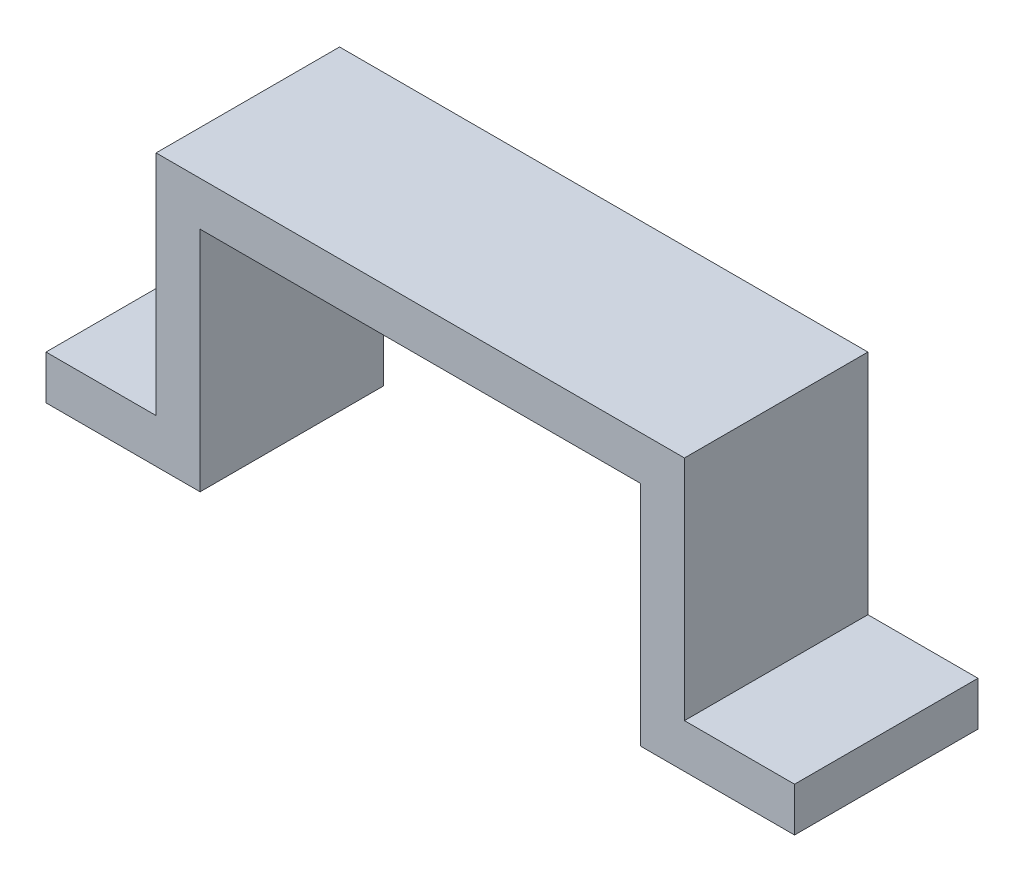
ISO-10303-21;
HEADER;
FILE_DESCRIPTION(('STEP AP214'),'2;1');
FILE_NAME('part.step','',(''),(''),'','','');
FILE_SCHEMA(('AUTOMOTIVE_DESIGN { 1 0 10303 214 1 1 1 1 }'));
ENDSEC;
DATA;
#1=APPLICATION_CONTEXT('core data for automotive mechanical design processes');
#2=APPLICATION_PROTOCOL_DEFINITION('international standard','automotive_design',2000,#1);
#3=PRODUCT_CONTEXT('',#1,'mechanical');
#4=PRODUCT('Part','Part','',(#3));
#5=PRODUCT_RELATED_PRODUCT_CATEGORY('part','',(#4));
#6=PRODUCT_DEFINITION_FORMATION('','',#4);
#7=PRODUCT_DEFINITION_CONTEXT('part definition',#1,'design');
#8=PRODUCT_DEFINITION('design','',#6,#7);
#9=PRODUCT_DEFINITION_SHAPE('','',#8);
#10=(LENGTH_UNIT() NAMED_UNIT(*) SI_UNIT(.MILLI.,.METRE.));
#11=(NAMED_UNIT(*) PLANE_ANGLE_UNIT() SI_UNIT($,.RADIAN.));
#12=(NAMED_UNIT(*) SI_UNIT($,.STERADIAN.) SOLID_ANGLE_UNIT());
#13=UNCERTAINTY_MEASURE_WITH_UNIT(LENGTH_MEASURE(1.E-05),#10,'distance_accuracy_value','');
#14=(GEOMETRIC_REPRESENTATION_CONTEXT(3) GLOBAL_UNCERTAINTY_ASSIGNED_CONTEXT((#13)) GLOBAL_UNIT_ASSIGNED_CONTEXT((#10,
#11,#12)) REPRESENTATION_CONTEXT('',''));
#15=CARTESIAN_POINT('',(0.,0.,0.));
#16=DIRECTION('',(0.,0.,1.));
#17=DIRECTION('',(1.,0.,0.));
#18=AXIS2_PLACEMENT_3D('',#15,#16,#17);
#19=CARTESIAN_POINT('',(0.,-6.,-25.));
#20=DIRECTION('',(1.,0.,0.));
#21=DIRECTION('',(0.,0.,1.));
#22=AXIS2_PLACEMENT_3D('',#19,#20,#21);
#23=PLANE('',#22);
#24=DIRECTION('',(0.,-1.,0.));
#25=VECTOR('',#24,1.);
#26=CARTESIAN_POINT('',(0.,-6.,0.));
#27=LINE('',#26,#25);
#28=CARTESIAN_POINT('',(0.,0.,0.));
#29=VERTEX_POINT('',#28);
#30=CARTESIAN_POINT('',(0.,-6.,0.));
#31=VERTEX_POINT('',#30);
#32=EDGE_CURVE('E157',#29,#31,#27,.T.);
#33=ORIENTED_EDGE('',*,*,#32,.F.);
#34=DIRECTION('',(0.,0.,1.));
#35=VECTOR('',#34,1.);
#36=CARTESIAN_POINT('',(0.,0.,-25.));
#37=LINE('',#36,#35);
#38=CARTESIAN_POINT('',(0.,0.,-25.));
#39=VERTEX_POINT('',#38);
#40=EDGE_CURVE('E156',#39,#29,#37,.T.);
#41=ORIENTED_EDGE('',*,*,#40,.F.);
#42=DIRECTION('',(0.,-1.,0.));
#43=VECTOR('',#42,1.);
#44=CARTESIAN_POINT('',(0.,-6.,-25.));
#45=LINE('',#44,#43);
#46=CARTESIAN_POINT('',(0.,-6.,-25.));
#47=VERTEX_POINT('',#46);
#48=EDGE_CURVE('E187',#39,#47,#45,.T.);
#49=ORIENTED_EDGE('',*,*,#48,.T.);
#50=DIRECTION('',(0.,0.,1.));
#51=VECTOR('',#50,1.);
#52=CARTESIAN_POINT('',(0.,-6.,-25.));
#53=LINE('',#52,#51);
#54=EDGE_CURVE('E11',#47,#31,#53,.T.);
#55=ORIENTED_EDGE('',*,*,#54,.T.);
#56=EDGE_LOOP('',(#33,#41,#49,#55));
#57=FACE_BOUND('',#56,.T.);
#58=ADVANCED_FACE('F37',(#57),#23,.F.);
#59=CARTESIAN_POINT('',(21.,-6.,-25.));
#60=DIRECTION('',(0.,1.,0.));
#61=DIRECTION('',(-1.,0.,0.));
#62=AXIS2_PLACEMENT_3D('',#59,#60,#61);
#63=PLANE('',#62);
#64=DIRECTION('',(1.,0.,0.));
#65=VECTOR('',#64,1.);
#66=CARTESIAN_POINT('',(21.,-6.,0.));
#67=LINE('',#66,#65);
#68=CARTESIAN_POINT('',(21.,-6.,0.));
#69=VERTEX_POINT('',#68);
#70=EDGE_CURVE('E159',#31,#69,#67,.T.);
#71=ORIENTED_EDGE('',*,*,#70,.F.);
#72=ORIENTED_EDGE('',*,*,#54,.F.);
#73=DIRECTION('',(1.,0.,0.));
#74=VECTOR('',#73,1.);
#75=CARTESIAN_POINT('',(21.,-6.,-25.));
#76=LINE('',#75,#74);
#77=CARTESIAN_POINT('',(21.,-6.,-25.));
#78=VERTEX_POINT('',#77);
#79=EDGE_CURVE('E103',#47,#78,#76,.T.);
#80=ORIENTED_EDGE('',*,*,#79,.T.);
#81=DIRECTION('',(0.,0.,1.));
#82=VECTOR('',#81,1.);
#83=CARTESIAN_POINT('',(21.,-6.,-25.));
#84=LINE('',#83,#82);
#85=EDGE_CURVE('E45',#78,#69,#84,.T.);
#86=ORIENTED_EDGE('',*,*,#85,.T.);
#87=EDGE_LOOP('',(#71,#72,#80,#86));
#88=FACE_BOUND('',#87,.T.);
#89=ADVANCED_FACE('F211',(#88),#63,.F.);
#90=CARTESIAN_POINT('',(21.,25.,-25.));
#91=DIRECTION('',(-1.,0.,0.));
#92=DIRECTION('',(0.,-1.,0.));
#93=AXIS2_PLACEMENT_3D('',#90,#91,#92);
#94=PLANE('',#93);
#95=DIRECTION('',(0.,1.,0.));
#96=VECTOR('',#95,1.);
#97=CARTESIAN_POINT('',(21.,25.,0.));
#98=LINE('',#97,#96);
#99=CARTESIAN_POINT('',(21.,25.,0.));
#100=VERTEX_POINT('',#99);
#101=EDGE_CURVE('E162',#69,#100,#98,.T.);
#102=ORIENTED_EDGE('',*,*,#101,.F.);
#103=ORIENTED_EDGE('',*,*,#85,.F.);
#104=DIRECTION('',(0.,1.,0.));
#105=VECTOR('',#104,1.);
#106=CARTESIAN_POINT('',(21.,25.,-25.));
#107=LINE('',#106,#105);
#108=CARTESIAN_POINT('',(21.,25.,-25.));
#109=VERTEX_POINT('',#108);
#110=EDGE_CURVE('E220',#78,#109,#107,.T.);
#111=ORIENTED_EDGE('',*,*,#110,.T.);
#112=DIRECTION('',(0.,0.,1.));
#113=VECTOR('',#112,1.);
#114=CARTESIAN_POINT('',(21.,25.,-25.));
#115=LINE('',#114,#113);
#116=EDGE_CURVE('E206',#109,#100,#115,.T.);
#117=ORIENTED_EDGE('',*,*,#116,.T.);
#118=EDGE_LOOP('',(#102,#103,#111,#117));
#119=FACE_BOUND('',#118,.T.);
#120=ADVANCED_FACE('F254',(#119),#94,.F.);
#121=CARTESIAN_POINT('',(81.,25.,-25.));
#122=DIRECTION('',(0.,1.,0.));
#123=DIRECTION('',(-1.,0.,0.));
#124=AXIS2_PLACEMENT_3D('',#121,#122,#123);
#125=PLANE('',#124);
#126=DIRECTION('',(1.,0.,0.));
#127=VECTOR('',#126,1.);
#128=CARTESIAN_POINT('',(81.,25.,0.));
#129=LINE('',#128,#127);
#130=CARTESIAN_POINT('',(81.,25.,0.));
#131=VERTEX_POINT('',#130);
#132=EDGE_CURVE('E165',#100,#131,#129,.T.);
#133=ORIENTED_EDGE('',*,*,#132,.F.);
#134=ORIENTED_EDGE('',*,*,#116,.F.);
#135=DIRECTION('',(1.,0.,0.));
#136=VECTOR('',#135,1.);
#137=CARTESIAN_POINT('',(81.,25.,-25.));
#138=LINE('',#137,#136);
#139=CARTESIAN_POINT('',(81.,25.,-25.));
#140=VERTEX_POINT('',#139);
#141=EDGE_CURVE('E224',#109,#140,#138,.T.);
#142=ORIENTED_EDGE('',*,*,#141,.T.);
#143=DIRECTION('',(0.,0.,1.));
#144=VECTOR('',#143,1.);
#145=CARTESIAN_POINT('',(81.,25.,-25.));
#146=LINE('',#145,#144);
#147=EDGE_CURVE('E203',#140,#131,#146,.T.);
#148=ORIENTED_EDGE('',*,*,#147,.T.);
#149=EDGE_LOOP('',(#133,#134,#142,#148));
#150=FACE_BOUND('',#149,.T.);
#151=ADVANCED_FACE('F253',(#150),#125,.F.);
#152=CARTESIAN_POINT('',(81.,-6.,-25.));
#153=DIRECTION('',(1.,0.,0.));
#154=DIRECTION('',(0.,1.,0.));
#155=AXIS2_PLACEMENT_3D('',#152,#153,#154);
#156=PLANE('',#155);
#157=DIRECTION('',(0.,-1.,0.));
#158=VECTOR('',#157,1.);
#159=CARTESIAN_POINT('',(81.,-6.,0.));
#160=LINE('',#159,#158);
#161=CARTESIAN_POINT('',(81.,-6.,0.));
#162=VERTEX_POINT('',#161);
#163=EDGE_CURVE('E168',#131,#162,#160,.T.);
#164=ORIENTED_EDGE('',*,*,#163,.F.);
#165=ORIENTED_EDGE('',*,*,#147,.F.);
#166=DIRECTION('',(0.,-1.,0.));
#167=VECTOR('',#166,1.);
#168=CARTESIAN_POINT('',(81.,-6.,-25.));
#169=LINE('',#168,#167);
#170=CARTESIAN_POINT('',(81.,-6.,-25.));
#171=VERTEX_POINT('',#170);
#172=EDGE_CURVE('E227',#140,#171,#169,.T.);
#173=ORIENTED_EDGE('',*,*,#172,.T.);
#174=DIRECTION('',(0.,0.,1.));
#175=VECTOR('',#174,1.);
#176=CARTESIAN_POINT('',(81.,-6.,-25.));
#177=LINE('',#176,#175);
#178=EDGE_CURVE('E200',#171,#162,#177,.T.);
#179=ORIENTED_EDGE('',*,*,#178,.T.);
#180=EDGE_LOOP('',(#164,#165,#173,#179));
#181=FACE_BOUND('',#180,.T.);
#182=ADVANCED_FACE('F251',(#181),#156,.F.);
#183=CARTESIAN_POINT('',(102.,-6.,-25.));
#184=DIRECTION('',(0.,1.,0.));
#185=DIRECTION('',(-1.,0.,0.));
#186=AXIS2_PLACEMENT_3D('',#183,#184,#185);
#187=PLANE('',#186);
#188=DIRECTION('',(1.,0.,0.));
#189=VECTOR('',#188,1.);
#190=CARTESIAN_POINT('',(102.,-6.,0.));
#191=LINE('',#190,#189);
#192=CARTESIAN_POINT('',(102.,-6.,0.));
#193=VERTEX_POINT('',#192);
#194=EDGE_CURVE('E171',#162,#193,#191,.T.);
#195=ORIENTED_EDGE('',*,*,#194,.F.);
#196=ORIENTED_EDGE('',*,*,#178,.F.);
#197=DIRECTION('',(1.,0.,0.));
#198=VECTOR('',#197,1.);
#199=CARTESIAN_POINT('',(102.,-6.,-25.));
#200=LINE('',#199,#198);
#201=CARTESIAN_POINT('',(102.,-6.,-25.));
#202=VERTEX_POINT('',#201);
#203=EDGE_CURVE('E230',#171,#202,#200,.T.);
#204=ORIENTED_EDGE('',*,*,#203,.T.);
#205=DIRECTION('',(0.,0.,1.));
#206=VECTOR('',#205,1.);
#207=CARTESIAN_POINT('',(102.,-6.,-25.));
#208=LINE('',#207,#206);
#209=EDGE_CURVE('E197',#202,#193,#208,.T.);
#210=ORIENTED_EDGE('',*,*,#209,.T.);
#211=EDGE_LOOP('',(#195,#196,#204,#210));
#212=FACE_BOUND('',#211,.T.);
#213=ADVANCED_FACE('F247',(#212),#187,.F.);
#214=CARTESIAN_POINT('',(102.,0.,-25.));
#215=DIRECTION('',(-1.,0.,0.));
#216=DIRECTION('',(0.,0.,-1.));
#217=AXIS2_PLACEMENT_3D('',#214,#215,#216);
#218=PLANE('',#217);
#219=DIRECTION('',(0.,1.,0.));
#220=VECTOR('',#219,1.);
#221=CARTESIAN_POINT('',(102.,0.,0.));
#222=LINE('',#221,#220);
#223=CARTESIAN_POINT('',(102.,0.,0.));
#224=VERTEX_POINT('',#223);
#225=EDGE_CURVE('E174',#193,#224,#222,.T.);
#226=ORIENTED_EDGE('',*,*,#225,.F.);
#227=ORIENTED_EDGE('',*,*,#209,.F.);
#228=DIRECTION('',(0.,1.,0.));
#229=VECTOR('',#228,1.);
#230=CARTESIAN_POINT('',(102.,0.,-25.));
#231=LINE('',#230,#229);
#232=CARTESIAN_POINT('',(102.,0.,-25.));
#233=VERTEX_POINT('',#232);
#234=EDGE_CURVE('E233',#202,#233,#231,.T.);
#235=ORIENTED_EDGE('',*,*,#234,.T.);
#236=DIRECTION('',(0.,0.,1.));
#237=VECTOR('',#236,1.);
#238=CARTESIAN_POINT('',(102.,0.,-25.));
#239=LINE('',#238,#237);
#240=EDGE_CURVE('E194',#233,#224,#239,.T.);
#241=ORIENTED_EDGE('',*,*,#240,.T.);
#242=EDGE_LOOP('',(#226,#227,#235,#241));
#243=FACE_BOUND('',#242,.T.);
#244=ADVANCED_FACE('F244',(#243),#218,.F.);
#245=CARTESIAN_POINT('',(87.,0.,-25.));
#246=DIRECTION('',(0.,-1.,0.));
#247=DIRECTION('',(1.,0.,0.));
#248=AXIS2_PLACEMENT_3D('',#245,#246,#247);
#249=PLANE('',#248);
#250=DIRECTION('',(-1.,0.,0.));
#251=VECTOR('',#250,1.);
#252=CARTESIAN_POINT('',(87.,0.,0.));
#253=LINE('',#252,#251);
#254=CARTESIAN_POINT('',(87.,0.,0.));
#255=VERTEX_POINT('',#254);
#256=EDGE_CURVE('E177',#224,#255,#253,.T.);
#257=ORIENTED_EDGE('',*,*,#256,.F.);
#258=ORIENTED_EDGE('',*,*,#240,.F.);
#259=DIRECTION('',(-1.,0.,0.));
#260=VECTOR('',#259,1.);
#261=CARTESIAN_POINT('',(87.,0.,-25.));
#262=LINE('',#261,#260);
#263=CARTESIAN_POINT('',(87.,0.,-25.));
#264=VERTEX_POINT('',#263);
#265=EDGE_CURVE('E151',#233,#264,#262,.T.);
#266=ORIENTED_EDGE('',*,*,#265,.T.);
#267=DIRECTION('',(0.,0.,1.));
#268=VECTOR('',#267,1.);
#269=CARTESIAN_POINT('',(87.,0.,-25.));
#270=LINE('',#269,#268);
#271=EDGE_CURVE('E191',#264,#255,#270,.T.);
#272=ORIENTED_EDGE('',*,*,#271,.T.);
#273=EDGE_LOOP('',(#257,#258,#266,#272));
#274=FACE_BOUND('',#273,.T.);
#275=ADVANCED_FACE('F238',(#274),#249,.F.);
#276=CARTESIAN_POINT('',(87.,31.,-25.));
#277=DIRECTION('',(-1.,0.,0.));
#278=DIRECTION('',(0.,0.,-1.));
#279=AXIS2_PLACEMENT_3D('',#276,#277,#278);
#280=PLANE('',#279);
#281=DIRECTION('',(0.,1.,0.));
#282=VECTOR('',#281,1.);
#283=CARTESIAN_POINT('',(87.,31.,0.));
#284=LINE('',#283,#282);
#285=CARTESIAN_POINT('',(87.,31.,0.));
#286=VERTEX_POINT('',#285);
#287=EDGE_CURVE('E180',#255,#286,#284,.T.);
#288=ORIENTED_EDGE('',*,*,#287,.F.);
#289=ORIENTED_EDGE('',*,*,#271,.F.);
#290=DIRECTION('',(0.,1.,0.));
#291=VECTOR('',#290,1.);
#292=CARTESIAN_POINT('',(87.,31.,-25.));
#293=LINE('',#292,#291);
#294=CARTESIAN_POINT('',(87.,31.,-25.));
#295=VERTEX_POINT('',#294);
#296=EDGE_CURVE('E149',#264,#295,#293,.T.);
#297=ORIENTED_EDGE('',*,*,#296,.T.);
#298=DIRECTION('',(0.,0.,1.));
#299=VECTOR('',#298,1.);
#300=CARTESIAN_POINT('',(87.,31.,-25.));
#301=LINE('',#300,#299);
#302=EDGE_CURVE('E143',#295,#286,#301,.T.);
#303=ORIENTED_EDGE('',*,*,#302,.T.);
#304=EDGE_LOOP('',(#288,#289,#297,#303));
#305=FACE_BOUND('',#304,.T.);
#306=ADVANCED_FACE('F242',(#305),#280,.F.);
#307=CARTESIAN_POINT('',(15.,31.,-25.));
#308=DIRECTION('',(0.,-1.,0.));
#309=DIRECTION('',(0.,0.,1.));
#310=AXIS2_PLACEMENT_3D('',#307,#308,#309);
#311=PLANE('',#310);
#312=DIRECTION('',(-1.,0.,0.));
#313=VECTOR('',#312,1.);
#314=CARTESIAN_POINT('',(15.,31.,0.));
#315=LINE('',#314,#313);
#316=CARTESIAN_POINT('',(15.,31.,0.));
#317=VERTEX_POINT('',#316);
#318=EDGE_CURVE('E183',#286,#317,#315,.T.);
#319=ORIENTED_EDGE('',*,*,#318,.F.);
#320=ORIENTED_EDGE('',*,*,#302,.F.);
#321=DIRECTION('',(-1.,0.,0.));
#322=VECTOR('',#321,1.);
#323=CARTESIAN_POINT('',(15.,31.,-25.));
#324=LINE('',#323,#322);
#325=CARTESIAN_POINT('',(15.,31.,-25.));
#326=VERTEX_POINT('',#325);
#327=EDGE_CURVE('E133',#295,#326,#324,.T.);
#328=ORIENTED_EDGE('',*,*,#327,.T.);
#329=DIRECTION('',(0.,0.,1.));
#330=VECTOR('',#329,1.);
#331=CARTESIAN_POINT('',(15.,31.,-25.));
#332=LINE('',#331,#330);
#333=EDGE_CURVE('E138',#326,#317,#332,.T.);
#334=ORIENTED_EDGE('',*,*,#333,.T.);
#335=EDGE_LOOP('',(#319,#320,#328,#334));
#336=FACE_BOUND('',#335,.T.);
#337=ADVANCED_FACE('F146',(#336),#311,.F.);
#338=CARTESIAN_POINT('',(15.,0.,-25.));
#339=DIRECTION('',(1.,0.,0.));
#340=DIRECTION('',(0.,0.,1.));
#341=AXIS2_PLACEMENT_3D('',#338,#339,#340);
#342=PLANE('',#341);
#343=DIRECTION('',(0.,-1.,0.));
#344=VECTOR('',#343,1.);
#345=CARTESIAN_POINT('',(15.,0.,0.));
#346=LINE('',#345,#344);
#347=CARTESIAN_POINT('',(15.,0.,0.));
#348=VERTEX_POINT('',#347);
#349=EDGE_CURVE('E140',#317,#348,#346,.T.);
#350=ORIENTED_EDGE('',*,*,#349,.F.);
#351=ORIENTED_EDGE('',*,*,#333,.F.);
#352=DIRECTION('',(0.,-1.,0.));
#353=VECTOR('',#352,1.);
#354=CARTESIAN_POINT('',(15.,0.,-25.));
#355=LINE('',#354,#353);
#356=CARTESIAN_POINT('',(15.,0.,-25.));
#357=VERTEX_POINT('',#356);
#358=EDGE_CURVE('E129',#326,#357,#355,.T.);
#359=ORIENTED_EDGE('',*,*,#358,.T.);
#360=DIRECTION('',(0.,0.,1.));
#361=VECTOR('',#360,1.);
#362=CARTESIAN_POINT('',(15.,0.,-25.));
#363=LINE('',#362,#361);
#364=EDGE_CURVE('E144',#357,#348,#363,.T.);
#365=ORIENTED_EDGE('',*,*,#364,.T.);
#366=EDGE_LOOP('',(#350,#351,#359,#365));
#367=FACE_BOUND('',#366,.T.);
#368=ADVANCED_FACE('F139',(#367),#342,.F.);
#369=CARTESIAN_POINT('',(0.,0.,-25.));
#370=DIRECTION('',(0.,-1.,0.));
#371=DIRECTION('',(0.,0.,1.));
#372=AXIS2_PLACEMENT_3D('',#369,#370,#371);
#373=PLANE('',#372);
#374=DIRECTION('',(-1.,0.,0.));
#375=VECTOR('',#374,1.);
#376=CARTESIAN_POINT('',(0.,0.,0.));
#377=LINE('',#376,#375);
#378=EDGE_CURVE('E91',#348,#29,#377,.T.);
#379=ORIENTED_EDGE('',*,*,#378,.F.);
#380=ORIENTED_EDGE('',*,*,#364,.F.);
#381=DIRECTION('',(-1.,0.,0.));
#382=VECTOR('',#381,1.);
#383=CARTESIAN_POINT('',(0.,0.,-25.));
#384=LINE('',#383,#382);
#385=EDGE_CURVE('E53',#357,#39,#384,.T.);
#386=ORIENTED_EDGE('',*,*,#385,.T.);
#387=ORIENTED_EDGE('',*,*,#40,.T.);
#388=EDGE_LOOP('',(#379,#380,#386,#387));
#389=FACE_BOUND('',#388,.T.);
#390=ADVANCED_FACE('F336',(#389),#373,.F.);
#391=CARTESIAN_POINT('',(0.,0.,-25.));
#392=DIRECTION('',(0.,0.,1.));
#393=DIRECTION('',(-1.,0.,0.));
#394=AXIS2_PLACEMENT_3D('',#391,#392,#393);
#395=PLANE('',#394);
#396=ORIENTED_EDGE('',*,*,#48,.F.);
#397=ORIENTED_EDGE('',*,*,#385,.F.);
#398=ORIENTED_EDGE('',*,*,#358,.F.);
#399=ORIENTED_EDGE('',*,*,#327,.F.);
#400=ORIENTED_EDGE('',*,*,#296,.F.);
#401=ORIENTED_EDGE('',*,*,#265,.F.);
#402=ORIENTED_EDGE('',*,*,#234,.F.);
#403=ORIENTED_EDGE('',*,*,#203,.F.);
#404=ORIENTED_EDGE('',*,*,#172,.F.);
#405=ORIENTED_EDGE('',*,*,#141,.F.);
#406=ORIENTED_EDGE('',*,*,#110,.F.);
#407=ORIENTED_EDGE('',*,*,#79,.F.);
#408=EDGE_LOOP('',(#396,#397,#398,#399,#400,#401,#402,#403,#404,#405,#406,#407));
#409=FACE_BOUND('',#408,.T.);
#410=ADVANCED_FACE('F131',(#409),#395,.F.);
#411=CARTESIAN_POINT('',(0.,0.,0.));
#412=DIRECTION('',(0.,0.,1.));
#413=DIRECTION('',(-1.,0.,0.));
#414=AXIS2_PLACEMENT_3D('',#411,#412,#413);
#415=PLANE('',#414);
#416=ORIENTED_EDGE('',*,*,#32,.T.);
#417=ORIENTED_EDGE('',*,*,#70,.T.);
#418=ORIENTED_EDGE('',*,*,#101,.T.);
#419=ORIENTED_EDGE('',*,*,#132,.T.);
#420=ORIENTED_EDGE('',*,*,#163,.T.);
#421=ORIENTED_EDGE('',*,*,#194,.T.);
#422=ORIENTED_EDGE('',*,*,#225,.T.);
#423=ORIENTED_EDGE('',*,*,#256,.T.);
#424=ORIENTED_EDGE('',*,*,#287,.T.);
#425=ORIENTED_EDGE('',*,*,#318,.T.);
#426=ORIENTED_EDGE('',*,*,#349,.T.);
#427=ORIENTED_EDGE('',*,*,#378,.T.);
#428=EDGE_LOOP('',(#416,#417,#418,#419,#420,#421,#422,#423,#424,#425,#426,#427));
#429=FACE_BOUND('',#428,.T.);
#430=ADVANCED_FACE('F214',(#429),#415,.T.);
#431=CLOSED_SHELL('',(#58,#89,#120,#151,#182,#213,#244,#275,#306,#337,#368,#390,#410,#430));
#432=MANIFOLD_SOLID_BREP('B2',#431);
#433=ADVANCED_BREP_SHAPE_REPRESENTATION('',(#18,#432),#14);
#434=SHAPE_DEFINITION_REPRESENTATION(#9,#433);
ENDSEC;
END-ISO-10303-21;
